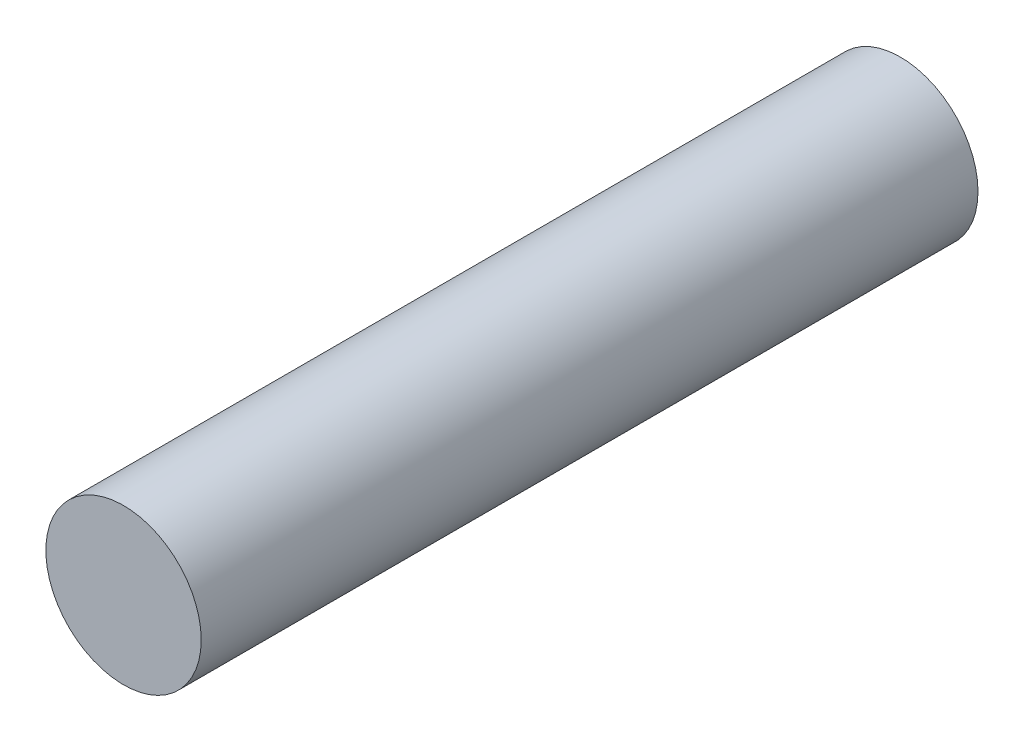
ISO-10303-21;
HEADER;
FILE_DESCRIPTION(('STEP AP214'),'2;1');
FILE_NAME('part.step','',(''),(''),'','','');
FILE_SCHEMA(('AUTOMOTIVE_DESIGN { 1 0 10303 214 1 1 1 1 }'));
ENDSEC;
DATA;
#1=APPLICATION_CONTEXT('core data for automotive mechanical design processes');
#2=APPLICATION_PROTOCOL_DEFINITION('international standard','automotive_design',2000,#1);
#3=PRODUCT_CONTEXT('',#1,'mechanical');
#4=PRODUCT('Part','Part','',(#3));
#5=PRODUCT_RELATED_PRODUCT_CATEGORY('part','',(#4));
#6=PRODUCT_DEFINITION_FORMATION('','',#4);
#7=PRODUCT_DEFINITION_CONTEXT('part definition',#1,'design');
#8=PRODUCT_DEFINITION('design','',#6,#7);
#9=PRODUCT_DEFINITION_SHAPE('','',#8);
#10=(LENGTH_UNIT() NAMED_UNIT(*) SI_UNIT(.MILLI.,.METRE.));
#11=(NAMED_UNIT(*) PLANE_ANGLE_UNIT() SI_UNIT($,.RADIAN.));
#12=(NAMED_UNIT(*) SI_UNIT($,.STERADIAN.) SOLID_ANGLE_UNIT());
#13=UNCERTAINTY_MEASURE_WITH_UNIT(LENGTH_MEASURE(1.E-05),#10,'distance_accuracy_value','');
#14=(GEOMETRIC_REPRESENTATION_CONTEXT(3) GLOBAL_UNCERTAINTY_ASSIGNED_CONTEXT((#13)) GLOBAL_UNIT_ASSIGNED_CONTEXT((#10,
#11,#12)) REPRESENTATION_CONTEXT('',''));
#15=CARTESIAN_POINT('',(0.,0.,0.));
#16=DIRECTION('',(0.,0.,1.));
#17=DIRECTION('',(1.,0.,0.));
#18=AXIS2_PLACEMENT_3D('',#15,#16,#17);
#19=CARTESIAN_POINT('',(0.,0.,31.75));
#20=DIRECTION('',(0.,0.,-1.));
#21=DIRECTION('',(-1.,0.,0.));
#22=AXIS2_PLACEMENT_3D('',#19,#20,#21);
#23=CYLINDRICAL_SURFACE('',#22,3.175);
#24=CARTESIAN_POINT('',(0.,0.,31.75));
#25=DIRECTION('',(0.,0.,1.));
#26=DIRECTION('',(1.,0.,0.));
#27=AXIS2_PLACEMENT_3D('',#24,#25,#26);
#28=CIRCLE('',#27,3.175);
#29=CARTESIAN_POINT('',(3.175,0.,31.75));
#30=VERTEX_POINT('',#29);
#31=EDGE_CURVE('E10',#30,#30,#28,.T.);
#32=ORIENTED_EDGE('',*,*,#31,.F.);
#33=EDGE_LOOP('',(#32));
#34=FACE_BOUND('',#33,.T.);
#35=CARTESIAN_POINT('',(0.,0.,0.));
#36=DIRECTION('',(0.,0.,1.));
#37=DIRECTION('',(1.,0.,0.));
#38=AXIS2_PLACEMENT_3D('',#35,#36,#37);
#39=CIRCLE('',#38,3.175);
#40=CARTESIAN_POINT('',(3.175,0.,0.));
#41=VERTEX_POINT('',#40);
#42=EDGE_CURVE('E34',#41,#41,#39,.T.);
#43=ORIENTED_EDGE('',*,*,#42,.T.);
#44=EDGE_LOOP('',(#43));
#45=FACE_BOUND('',#44,.T.);
#46=ADVANCED_FACE('F31',(#34,#45),#23,.T.);
#47=CARTESIAN_POINT('',(0.,0.,31.75));
#48=DIRECTION('',(0.,0.,1.));
#49=DIRECTION('',(1.,0.,0.));
#50=AXIS2_PLACEMENT_3D('',#47,#48,#49);
#51=PLANE('',#50);
#52=ORIENTED_EDGE('',*,*,#31,.T.);
#53=EDGE_LOOP('',(#52));
#54=FACE_BOUND('',#53,.T.);
#55=ADVANCED_FACE('F46',(#54),#51,.T.);
#56=CARTESIAN_POINT('',(0.,0.,0.));
#57=DIRECTION('',(0.,0.,1.));
#58=DIRECTION('',(1.,0.,0.));
#59=AXIS2_PLACEMENT_3D('',#56,#57,#58);
#60=PLANE('',#59);
#61=ORIENTED_EDGE('',*,*,#42,.F.);
#62=EDGE_LOOP('',(#61));
#63=FACE_BOUND('',#62,.T.);
#64=ADVANCED_FACE('F44',(#63),#60,.F.);
#65=CLOSED_SHELL('',(#46,#55,#64));
#66=MANIFOLD_SOLID_BREP('B2',#65);
#67=ADVANCED_BREP_SHAPE_REPRESENTATION('',(#18,#66),#14);
#68=SHAPE_DEFINITION_REPRESENTATION(#9,#67);
ENDSEC;
END-ISO-10303-21;
